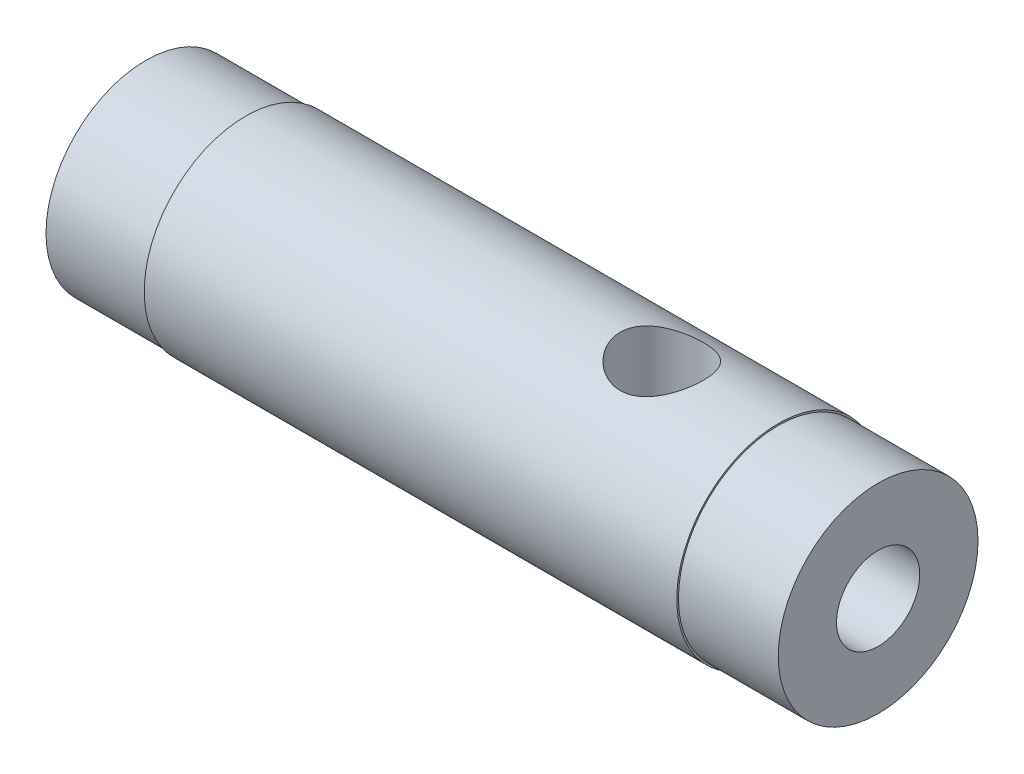
ISO-10303-21;
HEADER;
FILE_DESCRIPTION(('STEP AP214'),'2;1');
FILE_NAME('part.step','',(''),(''),'','','');
FILE_SCHEMA(('AUTOMOTIVE_DESIGN { 1 0 10303 214 1 1 1 1 }'));
ENDSEC;
DATA;
#1=APPLICATION_CONTEXT('core data for automotive mechanical design processes');
#2=APPLICATION_PROTOCOL_DEFINITION('international standard','automotive_design',2000,#1);
#3=PRODUCT_CONTEXT('',#1,'mechanical');
#4=PRODUCT('Part','Part','',(#3));
#5=PRODUCT_RELATED_PRODUCT_CATEGORY('part','',(#4));
#6=PRODUCT_DEFINITION_FORMATION('','',#4);
#7=PRODUCT_DEFINITION_CONTEXT('part definition',#1,'design');
#8=PRODUCT_DEFINITION('design','',#6,#7);
#9=PRODUCT_DEFINITION_SHAPE('','',#8);
#10=(LENGTH_UNIT() NAMED_UNIT(*) SI_UNIT(.MILLI.,.METRE.));
#11=(NAMED_UNIT(*) PLANE_ANGLE_UNIT() SI_UNIT($,.RADIAN.));
#12=(NAMED_UNIT(*) SI_UNIT($,.STERADIAN.) SOLID_ANGLE_UNIT());
#13=UNCERTAINTY_MEASURE_WITH_UNIT(LENGTH_MEASURE(1.E-05),#10,'distance_accuracy_value','');
#14=(GEOMETRIC_REPRESENTATION_CONTEXT(3) GLOBAL_UNCERTAINTY_ASSIGNED_CONTEXT((#13)) GLOBAL_UNIT_ASSIGNED_CONTEXT((#10,
#11,#12)) REPRESENTATION_CONTEXT('',''));
#15=CARTESIAN_POINT('',(0.,0.,0.));
#16=DIRECTION('',(0.,0.,1.));
#17=DIRECTION('',(1.,0.,0.));
#18=AXIS2_PLACEMENT_3D('',#15,#16,#17);
#19=CARTESIAN_POINT('',(-97.1117705949657,0.,0.));
#20=DIRECTION('',(1.,0.,0.));
#21=DIRECTION('',(0.,0.,-1.));
#22=AXIS2_PLACEMENT_3D('',#19,#20,#21);
#23=CYLINDRICAL_SURFACE('',#22,3.05000000000001);
#24=CARTESIAN_POINT('',(-8.00000000000001,0.,0.));
#25=DIRECTION('',(1.,0.,0.));
#26=DIRECTION('',(0.,0.,-1.));
#27=AXIS2_PLACEMENT_3D('',#24,#25,#26);
#28=CIRCLE('',#27,3.05000000000001);
#29=CARTESIAN_POINT('',(-8.00000000000001,0.,-3.05000000000001));
#30=VERTEX_POINT('',#29);
#31=EDGE_CURVE('E127',#30,#30,#28,.T.);
#32=ORIENTED_EDGE('',*,*,#31,.T.);
#33=EDGE_LOOP('',(#32));
#34=FACE_BOUND('',#33,.T.);
#35=CARTESIAN_POINT('',(8.00000000000001,0.,0.));
#36=DIRECTION('',(1.,0.,0.));
#37=DIRECTION('',(0.,0.,-1.));
#38=AXIS2_PLACEMENT_3D('',#35,#36,#37);
#39=CIRCLE('',#38,3.05000000000001);
#40=CARTESIAN_POINT('',(8.00000000000001,0.,-3.05000000000001));
#41=VERTEX_POINT('',#40);
#42=EDGE_CURVE('E130',#41,#41,#39,.T.);
#43=ORIENTED_EDGE('',*,*,#42,.F.);
#44=EDGE_LOOP('',(#43));
#45=FACE_BOUND('',#44,.T.);
#46=CARTESIAN_POINT('',(5.75,3.05000000000001,0.));
#47=CARTESIAN_POINT('',(5.74999317358084,3.04999490136042,0.0670510544943488));
#48=CARTESIAN_POINT('',(5.7445728904159,3.04776316601175,0.13421220939516));
#49=CARTESIAN_POINT('',(5.72308214272691,3.03905220749817,0.266635315129613));
#50=CARTESIAN_POINT('',(5.7069833965083,3.03256170556951,0.331891740879612));
#51=CARTESIAN_POINT('',(5.66482596800736,3.01603149034564,0.458374292847516));
#52=CARTESIAN_POINT('',(5.63880056530878,3.00600364451596,0.519613092935801));
#53=CARTESIAN_POINT('',(5.57766372514542,2.98337979201623,0.636797753940146));
#54=CARTESIAN_POINT('',(5.54255520538644,2.97078461030853,0.692745306660152));
#55=CARTESIAN_POINT('',(5.46243359833868,2.94360272183733,0.800582682290264));
#56=CARTESIAN_POINT('',(5.41704813784626,2.92895218720806,0.852179618836314));
#57=CARTESIAN_POINT('',(5.31844769395315,2.89959358202881,0.94727980579278));
#58=CARTESIAN_POINT('',(5.26522873562099,2.88488548598072,0.990778921618126));
#59=CARTESIAN_POINT('',(5.14942208796871,2.85630174305005,1.07047635819199));
#60=CARTESIAN_POINT('',(5.08651058665789,2.84249824263374,1.10623272255294));
#61=CARTESIAN_POINT('',(4.95491722684178,2.81829427065236,1.16652509902148));
#62=CARTESIAN_POINT('',(4.88623826542879,2.80789210323987,1.1910667050528));
#63=CARTESIAN_POINT('',(4.74842884283273,2.79235707938263,1.227033698322));
#64=CARTESIAN_POINT('',(4.67947149284317,2.78699943260885,1.23902161527503));
#65=CARTESIAN_POINT('',(4.54033187566907,2.78151145539134,1.25129693566521));
#66=CARTESIAN_POINT('',(4.47015027248522,2.78137837438495,1.25159049579919));
#67=CARTESIAN_POINT('',(4.33607409840986,2.78616368996564,1.24089353762405));
#68=CARTESIAN_POINT('',(4.27209740726591,2.7907104791605,1.23073314256809));
#69=CARTESIAN_POINT('',(4.14685271703793,2.80371701324259,1.20080567936669));
#70=CARTESIAN_POINT('',(4.08558521945647,2.81217747930139,1.18103684064336));
#71=CARTESIAN_POINT('',(3.96597856734735,2.8322471574019,1.13207159424285));
#72=CARTESIAN_POINT('',(3.90772757534972,2.84391858333762,1.10268647565431));
#73=CARTESIAN_POINT('',(3.79676189319712,2.86907953784481,1.03545581744839));
#74=CARTESIAN_POINT('',(3.74404935655717,2.88256976900068,0.997607004659702));
#75=CARTESIAN_POINT('',(3.64113506271574,2.91118669367847,0.910899790311777));
#76=CARTESIAN_POINT('',(3.59148817119212,2.92635714795842,0.861395461770469));
#77=CARTESIAN_POINT('',(3.50101833818233,2.95569448523892,0.754608431641011));
#78=CARTESIAN_POINT('',(3.46019733238115,2.96986114763169,0.697324028210361));
#79=CARTESIAN_POINT('',(3.38776019476993,2.99598214323012,0.574963428546575));
#80=CARTESIAN_POINT('',(3.35636271935723,3.00788187819975,0.509745275727025));
#81=CARTESIAN_POINT('',(3.30517803112996,3.0277118513072,0.37434088842293));
#82=CARTESIAN_POINT('',(3.28538461664023,3.03564420943662,0.304157330168565));
#83=CARTESIAN_POINT('',(3.25911499785756,3.04625363825053,0.165457200410405));
#84=CARTESIAN_POINT('',(3.25189372784432,3.04922426910948,0.0971041510370846));
#85=CARTESIAN_POINT('',(3.24876092149754,3.05050746127451,-0.0398955862818339));
#86=CARTESIAN_POINT('',(3.25284627086616,3.04882130524733,-0.108542188170875));
#87=CARTESIAN_POINT('',(3.27167121733154,3.04117156509263,-0.240737900013712));
#88=CARTESIAN_POINT('',(3.28589367478942,3.03541570476585,-0.304374017081181));
#89=CARTESIAN_POINT('',(3.32387605471634,3.02042451329167,-0.428291837516551));
#90=CARTESIAN_POINT('',(3.34763719121059,3.01118873925114,-0.488573112788121));
#91=CARTESIAN_POINT('',(3.40479928404273,2.98977295322552,-0.606169889878375));
#92=CARTESIAN_POINT('',(3.43847544195123,2.97751077732147,-0.663336176977042));
#93=CARTESIAN_POINT('',(3.51420811639302,2.95135965585716,-0.771409581257715));
#94=CARTESIAN_POINT('',(3.55626807827196,2.93747004246778,-0.822314111200647));
#95=CARTESIAN_POINT('',(3.65098440399942,2.90837761739881,-0.92012008901335));
#96=CARTESIAN_POINT('',(3.70417275944045,2.89315046142816,-0.966500457883186));
#97=CARTESIAN_POINT('',(3.81783195761041,2.86397295744694,-1.04981547564094));
#98=CARTESIAN_POINT('',(3.87830425548019,2.85002286554326,-1.08674823252482));
#99=CARTESIAN_POINT('',(4.00591935720062,2.82491824303053,-1.15044727242197));
#100=CARTESIAN_POINT('',(4.0731350035576,2.81380017451011,-1.17708303960167));
#101=CARTESIAN_POINT('',(4.21169404128461,2.79614362783963,-1.21843997613925));
#102=CARTESIAN_POINT('',(4.28303413036748,2.78960153937765,-1.2331705397777));
#103=CARTESIAN_POINT('',(4.42205571719577,2.78237686582238,-1.24938002982017));
#104=CARTESIAN_POINT('',(4.48961071540186,2.78129189039515,-1.25176935125866));
#105=CARTESIAN_POINT('',(4.62411541510115,2.78404131006806,-1.245642582678));
#106=CARTESIAN_POINT('',(4.6910652011546,2.78787500688881,-1.23712804062635));
#107=CARTESIAN_POINT('',(4.8194595845332,2.79966724973415,-1.21019142460486));
#108=CARTESIAN_POINT('',(4.88101694579431,2.80743875303862,-1.19221729367759));
#109=CARTESIAN_POINT('',(5.00026093044538,2.82609039777682,-1.14730173944125));
#110=CARTESIAN_POINT('',(5.0579464682445,2.83697140660188,-1.12035781367662));
#111=CARTESIAN_POINT('',(5.17152052867125,2.86141244323643,-1.05643453179975));
#112=CARTESIAN_POINT('',(5.22710231558399,2.87509264152989,-1.0189569500526));
#113=CARTESIAN_POINT('',(5.33147333634056,2.90324259102356,-0.935740453402653));
#114=CARTESIAN_POINT('',(5.3802603307468,2.91771260035407,-0.889998826180312));
#115=CARTESIAN_POINT('',(5.47314082024466,2.94701985281456,-0.787775119330134));
#116=CARTESIAN_POINT('',(5.51667265144534,2.96181275182101,-0.730767593453201));
#117=CARTESIAN_POINT('',(5.59357367951556,2.98908126299054,-0.609702629948095));
#118=CARTESIAN_POINT('',(5.62693821461591,3.00155581115558,-0.545641976686485));
#119=CARTESIAN_POINT('',(5.68180811191665,3.02258806460316,-0.413363701295479));
#120=CARTESIAN_POINT('',(5.70351052450806,3.03121040731176,-0.345238284795166));
#121=CARTESIAN_POINT('',(5.73495872650017,3.04383134859935,-0.206003832466595));
#122=CARTESIAN_POINT('',(5.74474216568277,3.04784450441535,-0.134904929290663));
#123=CARTESIAN_POINT('',(5.74946289651355,3.0497805301545,-0.0423987566110851));
#124=CARTESIAN_POINT('',(5.75000215885385,3.05000161244388,-0.0212048840938348));
#125=CARTESIAN_POINT('',(5.75,3.05000000000001,0.));
#126=B_SPLINE_CURVE_WITH_KNOTS('',3,(#46,#47,#48,#49,#50,#51,#52,#53,#54,#55,#56,#57,#58,#59,
#60,#61,#62,#63,#64,#65,#66,#67,#68,#69,#70,#71,#72,#73,#74,#75,#76,#77,#78,#79,#80,#81,#82,#83,
#84,#85,#86,#87,#88,#89,#90,#91,#92,#93,#94,#95,#96,#97,#98,#99,#100,#101,#102,#103,#104,#105,
#106,#107,#108,#109,#110,#111,#112,#113,#114,#115,#116,#117,#118,#119,#120,#121,#122,#123,#124,
#125),.UNSPECIFIED.,.T.,.F.,(4,2,2,2,2,2,2,2,2,2,2,2,2,2,2,2,2,2,2,2,2,2,2,2,2,2,2,2,2,2,2,2,2,
2,2,2,2,2,2,4),(0.,0.201094311180328,0.402723354574276,0.603682285542813,0.804576743863711,
1.0144449209133,1.22441996030868,1.4443140997696,1.66409843594336,1.87354721803842,
2.08288573073389,2.27679448285736,2.47073898070665,2.66874390795884,2.86682554265504,
3.08105274490334,3.29532688370778,3.51424468844057,3.73304538781656,3.93837132545349,
4.14364071369574,4.33912550528583,4.53463518488674,4.73618655641972,4.93782092740473,
5.15341391236426,5.36905003881045,5.58733616568889,5.80544987646516,6.00721727204665,
6.20895602688517,6.40190297186304,6.59490379169179,6.79928960640034,7.00374262427852,
7.22240178249371,7.44116104698127,7.65609749208752,7.87035321839586,7.93394925864707),.UNSPECIFIED.);
#127=CARTESIAN_POINT('',(5.75,3.05000000000001,0.));
#128=VERTEX_POINT('',#127);
#129=EDGE_CURVE('E96',#128,#128,#126,.T.);
#130=ORIENTED_EDGE('',*,*,#129,.T.);
#131=EDGE_LOOP('',(#130));
#132=FACE_BOUND('',#131,.T.);
#133=ADVANCED_FACE('F33',(#34,#45,#132),#23,.T.);
#134=CARTESIAN_POINT('',(0.999999999999999,0.,0.));
#135=DIRECTION('',(1.,0.,0.));
#136=DIRECTION('',(0.,0.,-1.));
#137=AXIS2_PLACEMENT_3D('',#134,#135,#136);
#138=CYLINDRICAL_SURFACE('',#137,1.);
#139=CARTESIAN_POINT('',(9.,0.,0.));
#140=DIRECTION('',(1.,0.,0.));
#141=DIRECTION('',(0.,0.,-1.));
#142=AXIS2_PLACEMENT_3D('',#139,#140,#141);
#143=CIRCLE('',#142,1.);
#144=CARTESIAN_POINT('',(9.,0.,-1.));
#145=VERTEX_POINT('',#144);
#146=EDGE_CURVE('E102',#145,#145,#143,.T.);
#147=ORIENTED_EDGE('',*,*,#146,.T.);
#148=EDGE_LOOP('',(#147));
#149=FACE_BOUND('',#148,.T.);
#150=CARTESIAN_POINT('',(0.999999999999999,0.,0.));
#151=DIRECTION('',(1.,0.,0.));
#152=DIRECTION('',(0.,0.,-1.));
#153=AXIS2_PLACEMENT_3D('',#150,#151,#152);
#154=CIRCLE('',#153,1.);
#155=CARTESIAN_POINT('',(0.999999999999999,0.,-1.));
#156=VERTEX_POINT('',#155);
#157=EDGE_CURVE('E141',#156,#156,#154,.T.);
#158=ORIENTED_EDGE('',*,*,#157,.F.);
#159=EDGE_LOOP('',(#158));
#160=FACE_BOUND('',#159,.T.);
#161=DIRECTION('',(1.,0.,0.));
#162=VECTOR('',#161,1.);
#163=CARTESIAN_POINT('',(0.999999999999999,0.,1.));
#164=LINE('',#163,#162);
#165=CARTESIAN_POINT('',(5.25,0.,1.));
#166=VERTEX_POINT('',#165);
#167=CARTESIAN_POINT('',(3.75,0.,1.));
#168=VERTEX_POINT('',#167);
#169=EDGE_CURVE('E11',#166,#168,#164,.F.);
#170=ORIENTED_EDGE('',*,*,#169,.F.);
#171=CARTESIAN_POINT('',(5.25,0.,-1.));
#172=CARTESIAN_POINT('',(5.24987067623704,0.0380129766276087,-1.00004239994648));
#173=CARTESIAN_POINT('',(5.25289103004996,0.0758275155938789,-0.997836474983586));
#174=CARTESIAN_POINT('',(5.26397459584319,0.149745040245508,-0.989402301671296));
#175=CARTESIAN_POINT('',(5.27196843860068,0.185864339148891,-0.983229346307377));
#176=CARTESIAN_POINT('',(5.29534501534317,0.268707378731975,-0.964471732244661));
#177=CARTESIAN_POINT('',(5.31234690354174,0.314612386155176,-0.950384680660607));
#178=CARTESIAN_POINT('',(5.35037942272485,0.402784905806841,-0.916522193316677));
#179=CARTESIAN_POINT('',(5.37143922783841,0.445022652171018,-0.896705010558024));
#180=CARTESIAN_POINT('',(5.42313921194292,0.540201153030468,-0.843872960776305));
#181=CARTESIAN_POINT('',(5.45450402336844,0.591538827620781,-0.808674279042955));
#182=CARTESIAN_POINT('',(5.5164732592259,0.687035191040317,-0.729262171177428));
#183=CARTESIAN_POINT('',(5.54707901332387,0.731207314549791,-0.685065973845451));
#184=CARTESIAN_POINT('',(5.59895111616673,0.803549549289894,-0.59738381575907));
#185=CARTESIAN_POINT('',(5.62086929566955,0.833157650129419,-0.555474703797675));
#186=CARTESIAN_POINT('',(5.66082242902013,0.886178594795774,-0.466231173247663));
#187=CARTESIAN_POINT('',(5.67886270124157,0.909599933711891,-0.418904323224978));
#188=CARTESIAN_POINT('',(5.70707838724441,0.945856702533569,-0.327657998123031));
#189=CARTESIAN_POINT('',(5.7180539649432,0.959791646820216,-0.284425664917518));
#190=CARTESIAN_POINT('',(5.73542973000579,0.981749555646113,-0.195592838876207));
#191=CARTESIAN_POINT('',(5.74183253802269,0.989775906479984,-0.149993718545756));
#192=CARTESIAN_POINT('',(5.74953985523491,0.999429061049003,-0.0575240307640927));
#193=CARTESIAN_POINT('',(5.75082663121042,1.00103360560954,-0.0106496069422968));
#194=CARTESIAN_POINT('',(5.74813465733429,0.997667853243521,0.0827084607393311));
#195=CARTESIAN_POINT('',(5.74415569505575,0.992697291068389,0.129192088757809));
#196=CARTESIAN_POINT('',(5.73164197425201,0.976966189364718,0.217840752947662));
#197=CARTESIAN_POINT('',(5.72336742128652,0.96653608943226,0.260103069944626));
#198=CARTESIAN_POINT('',(5.70302304698824,0.940653126263295,0.342084024447004));
#199=CARTESIAN_POINT('',(5.69095208673973,0.925198755707235,0.381801894313005));
#200=CARTESIAN_POINT('',(5.66242932183417,0.888197321851619,0.461768671333843));
#201=CARTESIAN_POINT('',(5.64566730645162,0.86620643025013,0.501699422986387));
#202=CARTESIAN_POINT('',(5.60946555279251,0.817724747800801,0.577363035500914));
#203=CARTESIAN_POINT('',(5.59002495442489,0.791232510934534,0.613094541131814));
#204=CARTESIAN_POINT('',(5.54528145200121,0.728488383702324,0.687109623020992));
#205=CARTESIAN_POINT('',(5.5195949170613,0.691349706949347,0.724408177137869));
#206=CARTESIAN_POINT('',(5.46749193838368,0.611920872614312,0.792656695821792));
#207=CARTESIAN_POINT('',(5.44107391347094,0.569618750861443,0.823591452247028));
#208=CARTESIAN_POINT('',(5.39215418239367,0.484296418009533,0.876199052099706));
#209=CARTESIAN_POINT('',(5.36951864411519,0.441724573038847,0.898471959775695));
#210=CARTESIAN_POINT('',(5.32782480986552,0.352614668010067,0.937018513226683));
#211=CARTESIAN_POINT('',(5.30874361455761,0.306105020498242,0.953331263548851));
#212=CARTESIAN_POINT('',(5.27987865780746,0.21714294138014,0.977028295888454));
#213=CARTESIAN_POINT('',(5.26907025585784,0.175326495703558,0.985453607049307));
#214=CARTESIAN_POINT('',(5.25784464586782,0.110847940155437,0.994079660457727));
#215=CARTESIAN_POINT('',(5.25493122509159,0.0888777407056976,0.99628744460861));
#216=CARTESIAN_POINT('',(5.25099697362387,0.0446130051879239,0.999252642595954));
#217=CARTESIAN_POINT('',(5.24998135737073,0.0223177446473524,1.0000060605793));
#218=CARTESIAN_POINT('',(5.25000000000004,0.,1.00000000000001));
#219=B_SPLINE_CURVE_WITH_KNOTS('',3,(#171,#172,#173,#174,#175,#176,#177,#178,#179,#180,#181,
#182,#183,#184,#185,#186,#187,#188,#189,#190,#191,#192,#193,#194,#195,#196,#197,#198,#199,#200,
#201,#202,#203,#204,#205,#206,#207,#208,#209,#210,#211,#212,#213,#214,#215,#216,#217,#218),
.UNSPECIFIED.,.F.,.F.,(4,2,2,2,2,2,2,2,2,2,2,2,2,2,2,2,2,2,2,2,2,2,2,4),(0.,0.113538161589319,
0.225527159749816,0.37750471337288,0.530618672369757,0.738714715684919,0.946415974333433,
1.11318075129622,1.27971533775768,1.41931198339593,1.55882856189424,1.69882831414268,
1.83883371433993,1.97120612225622,2.10361827960958,2.24879963014769,2.39402770742755,
2.56910640453789,2.74459876318906,2.90345202850739,3.06124350350388,3.19245916340866,
3.25915499815905,3.32603381952746),.UNSPECIFIED.);
#220=CARTESIAN_POINT('',(5.25,0.,-1.));
#221=VERTEX_POINT('',#220);
#222=EDGE_CURVE('E41',#221,#166,#219,.T.);
#223=ORIENTED_EDGE('',*,*,#222,.F.);
#224=DIRECTION('',(1.,0.,0.));
#225=VECTOR('',#224,1.);
#226=CARTESIAN_POINT('',(0.999999999999999,0.,-1.));
#227=LINE('',#226,#225);
#228=CARTESIAN_POINT('',(3.75,0.,-1.));
#229=VERTEX_POINT('',#228);
#230=EDGE_CURVE('E69',#229,#221,#227,.T.);
#231=ORIENTED_EDGE('',*,*,#230,.F.);
#232=CARTESIAN_POINT('',(3.75,0.,1.));
#233=CARTESIAN_POINT('',(3.75012932376296,0.0380129766276086,1.00004239994648));
#234=CARTESIAN_POINT('',(3.74710896995004,0.075827515593879,0.997836474983586));
#235=CARTESIAN_POINT('',(3.73602540415681,0.149745040245508,0.989402301671296));
#236=CARTESIAN_POINT('',(3.72803156139932,0.185864339148891,0.983229346307377));
#237=CARTESIAN_POINT('',(3.70465498465683,0.268707378731975,0.964471732244661));
#238=CARTESIAN_POINT('',(3.68765309645826,0.314612386155176,0.950384680660607));
#239=CARTESIAN_POINT('',(3.64962057727515,0.40278490580684,0.916522193316677));
#240=CARTESIAN_POINT('',(3.62856077216159,0.445022652171018,0.896705010558024));
#241=CARTESIAN_POINT('',(3.57686078805707,0.540201153030468,0.843872960776305));
#242=CARTESIAN_POINT('',(3.54549597663156,0.591538827620781,0.808674279042955));
#243=CARTESIAN_POINT('',(3.4835267407741,0.687035191040317,0.729262171177429));
#244=CARTESIAN_POINT('',(3.45292098667613,0.731207314549791,0.685065973845451));
#245=CARTESIAN_POINT('',(3.40104888383327,0.803549549289893,0.597383815759071));
#246=CARTESIAN_POINT('',(3.37913070433045,0.833157650129419,0.555474703797676));
#247=CARTESIAN_POINT('',(3.33917757097987,0.886178594795774,0.466231173247663));
#248=CARTESIAN_POINT('',(3.32113729875843,0.909599933711891,0.418904323224979));
#249=CARTESIAN_POINT('',(3.29292161275559,0.945856702533569,0.327657998123032));
#250=CARTESIAN_POINT('',(3.2819460350568,0.959791646820216,0.284425664917519));
#251=CARTESIAN_POINT('',(3.26457026999421,0.981749555646113,0.195592838876208));
#252=CARTESIAN_POINT('',(3.25816746197731,0.989775906479984,0.149993718545757));
#253=CARTESIAN_POINT('',(3.25046014476509,0.999429061049002,0.0575240307640932));
#254=CARTESIAN_POINT('',(3.24917336878958,1.00103360560954,0.0106496069422972));
#255=CARTESIAN_POINT('',(3.25186534266571,0.997667853243521,-0.0827084607393306));
#256=CARTESIAN_POINT('',(3.25584430494425,0.992697291068389,-0.129192088757808));
#257=CARTESIAN_POINT('',(3.26835802574799,0.976966189364718,-0.217840752947662));
#258=CARTESIAN_POINT('',(3.27663257871348,0.966536089432261,-0.260103069944626));
#259=CARTESIAN_POINT('',(3.29697695301176,0.940653126263295,-0.342084024447004));
#260=CARTESIAN_POINT('',(3.30904791326026,0.925198755707236,-0.381801894313005));
#261=CARTESIAN_POINT('',(3.33757067816583,0.888197321851619,-0.461768671333843));
#262=CARTESIAN_POINT('',(3.35433269354838,0.86620643025013,-0.501699422986386));
#263=CARTESIAN_POINT('',(3.39053444720748,0.817724747800801,-0.577363035500914));
#264=CARTESIAN_POINT('',(3.40997504557511,0.791232510934535,-0.613094541131813));
#265=CARTESIAN_POINT('',(3.45471854799879,0.728488383702324,-0.687109623020991));
#266=CARTESIAN_POINT('',(3.4804050829387,0.691349706949348,-0.724408177137869));
#267=CARTESIAN_POINT('',(3.53250806161632,0.611920872614313,-0.792656695821792));
#268=CARTESIAN_POINT('',(3.55892608652906,0.569618750861443,-0.823591452247027));
#269=CARTESIAN_POINT('',(3.60784581760633,0.484296418009533,-0.876199052099706));
#270=CARTESIAN_POINT('',(3.63048135588481,0.441724573038847,-0.898471959775694));
#271=CARTESIAN_POINT('',(3.67217519013448,0.352614668010067,-0.937018513226683));
#272=CARTESIAN_POINT('',(3.69125638544239,0.306105020498242,-0.953331263548851));
#273=CARTESIAN_POINT('',(3.72012134219254,0.21714294138014,-0.977028295888454));
#274=CARTESIAN_POINT('',(3.73092974414216,0.175326495703558,-0.985453607049307));
#275=CARTESIAN_POINT('',(3.74215535413218,0.110847940155437,-0.994079660457727));
#276=CARTESIAN_POINT('',(3.74506877490841,0.0888777407056981,-0.99628744460861));
#277=CARTESIAN_POINT('',(3.74900302637612,0.0446130051879243,-0.999252642595954));
#278=CARTESIAN_POINT('',(3.75001864262927,0.0223177446473526,-1.0000060605793));
#279=CARTESIAN_POINT('',(3.74999999999996,0.,-1.00000000000001));
#280=B_SPLINE_CURVE_WITH_KNOTS('',3,(#232,#233,#234,#235,#236,#237,#238,#239,#240,#241,#242,
#243,#244,#245,#246,#247,#248,#249,#250,#251,#252,#253,#254,#255,#256,#257,#258,#259,#260,#261,
#262,#263,#264,#265,#266,#267,#268,#269,#270,#271,#272,#273,#274,#275,#276,#277,#278,#279),
.UNSPECIFIED.,.F.,.F.,(4,2,2,2,2,2,2,2,2,2,2,2,2,2,2,2,2,2,2,2,2,2,2,4),(0.,0.113538161589319,
0.225527159749816,0.37750471337288,0.530618672369757,0.738714715684919,0.946415974333432,
1.11318075129622,1.27971533775768,1.41931198339593,1.55882856189424,1.69882831414268,
1.83883371433993,1.97120612225622,2.10361827960958,2.24879963014769,2.39402770742755,
2.56910640453789,2.74459876318906,2.90345202850739,3.06124350350388,3.19245916340866,
3.25915499815905,3.32603381952746),.UNSPECIFIED.);
#281=EDGE_CURVE('E65',#168,#229,#280,.T.);
#282=ORIENTED_EDGE('',*,*,#281,.F.);
#283=EDGE_LOOP('',(#170,#223,#231,#282));
#284=FACE_BOUND('',#283,.T.);
#285=ADVANCED_FACE('F68',(#149,#160,#284),#138,.F.);
#286=CARTESIAN_POINT('',(-11.,0.,0.));
#287=DIRECTION('',(-1.,0.,0.));
#288=DIRECTION('',(0.,0.,1.));
#289=AXIS2_PLACEMENT_3D('',#286,#287,#288);
#290=PLANE('',#289);
#291=CARTESIAN_POINT('',(-11.,0.,0.));
#292=DIRECTION('',(1.,0.,0.));
#293=DIRECTION('',(0.,0.,-1.));
#294=AXIS2_PLACEMENT_3D('',#291,#292,#293);
#295=CIRCLE('',#294,3.00000000000001);
#296=CARTESIAN_POINT('',(-11.,0.,-3.00000000000001));
#297=VERTEX_POINT('',#296);
#298=EDGE_CURVE('E71',#297,#297,#295,.T.);
#299=ORIENTED_EDGE('',*,*,#298,.F.);
#300=EDGE_LOOP('',(#299));
#301=FACE_BOUND('',#300,.T.);
#302=ADVANCED_FACE('F35',(#301),#290,.T.);
#303=CARTESIAN_POINT('',(-97.1117705949657,0.,0.));
#304=DIRECTION('',(1.,0.,0.));
#305=DIRECTION('',(0.,0.,-1.));
#306=AXIS2_PLACEMENT_3D('',#303,#304,#305);
#307=CYLINDRICAL_SURFACE('',#306,3.00000000000001);
#308=ORIENTED_EDGE('',*,*,#298,.T.);
#309=EDGE_LOOP('',(#308));
#310=FACE_BOUND('',#309,.T.);
#311=CARTESIAN_POINT('',(-8.00000000000001,0.,0.));
#312=DIRECTION('',(1.,0.,0.));
#313=DIRECTION('',(0.,0.,-1.));
#314=AXIS2_PLACEMENT_3D('',#311,#312,#313);
#315=CIRCLE('',#314,3.00000000000001);
#316=CARTESIAN_POINT('',(-8.00000000000001,0.,-3.00000000000001));
#317=VERTEX_POINT('',#316);
#318=EDGE_CURVE('E126',#317,#317,#315,.T.);
#319=ORIENTED_EDGE('',*,*,#318,.F.);
#320=EDGE_LOOP('',(#319));
#321=FACE_BOUND('',#320,.T.);
#322=ADVANCED_FACE('F113',(#310,#321),#307,.T.);
#323=CARTESIAN_POINT('',(-8.,3.00000000000001,0.));
#324=DIRECTION('',(-1.,0.,0.));
#325=DIRECTION('',(0.,0.,1.));
#326=AXIS2_PLACEMENT_3D('',#323,#324,#325);
#327=PLANE('',#326);
#328=ORIENTED_EDGE('',*,*,#318,.T.);
#329=EDGE_LOOP('',(#328));
#330=FACE_BOUND('',#329,.T.);
#331=ORIENTED_EDGE('',*,*,#31,.F.);
#332=EDGE_LOOP('',(#331));
#333=FACE_BOUND('',#332,.T.);
#334=ADVANCED_FACE('F111',(#330,#333),#327,.T.);
#335=CARTESIAN_POINT('',(8.,3.05000000000001,0.));
#336=DIRECTION('',(1.,0.,0.));
#337=DIRECTION('',(0.,0.,-1.));
#338=AXIS2_PLACEMENT_3D('',#335,#336,#337);
#339=PLANE('',#338);
#340=ORIENTED_EDGE('',*,*,#42,.T.);
#341=EDGE_LOOP('',(#340));
#342=FACE_BOUND('',#341,.T.);
#343=CARTESIAN_POINT('',(8.00000000000001,0.,0.));
#344=DIRECTION('',(1.,0.,0.));
#345=DIRECTION('',(0.,0.,-1.));
#346=AXIS2_PLACEMENT_3D('',#343,#344,#345);
#347=CIRCLE('',#346,3.00000000000001);
#348=CARTESIAN_POINT('',(8.00000000000001,0.,-3.00000000000001));
#349=VERTEX_POINT('',#348);
#350=EDGE_CURVE('E135',#349,#349,#347,.T.);
#351=ORIENTED_EDGE('',*,*,#350,.F.);
#352=EDGE_LOOP('',(#351));
#353=FACE_BOUND('',#352,.T.);
#354=ADVANCED_FACE('F109',(#342,#353),#339,.T.);
#355=CARTESIAN_POINT('',(-97.1117705949657,0.,0.));
#356=DIRECTION('',(1.,0.,0.));
#357=DIRECTION('',(0.,0.,-1.));
#358=AXIS2_PLACEMENT_3D('',#355,#356,#357);
#359=CYLINDRICAL_SURFACE('',#358,3.00000000000001);
#360=ORIENTED_EDGE('',*,*,#350,.T.);
#361=EDGE_LOOP('',(#360));
#362=FACE_BOUND('',#361,.T.);
#363=CARTESIAN_POINT('',(11.,0.,0.));
#364=DIRECTION('',(1.,0.,0.));
#365=DIRECTION('',(0.,0.,-1.));
#366=AXIS2_PLACEMENT_3D('',#363,#364,#365);
#367=CIRCLE('',#366,3.00000000000001);
#368=CARTESIAN_POINT('',(11.,0.,-3.00000000000001));
#369=VERTEX_POINT('',#368);
#370=EDGE_CURVE('E138',#369,#369,#367,.T.);
#371=ORIENTED_EDGE('',*,*,#370,.F.);
#372=EDGE_LOOP('',(#371));
#373=FACE_BOUND('',#372,.T.);
#374=ADVANCED_FACE('F159',(#362,#373),#359,.T.);
#375=CARTESIAN_POINT('',(11.,3.00000000000001,0.));
#376=DIRECTION('',(1.,0.,0.));
#377=DIRECTION('',(0.,0.,-1.));
#378=AXIS2_PLACEMENT_3D('',#375,#376,#377);
#379=PLANE('',#378);
#380=CARTESIAN_POINT('',(11.,0.,0.));
#381=DIRECTION('',(1.,0.,0.));
#382=DIRECTION('',(0.,0.,-1.));
#383=AXIS2_PLACEMENT_3D('',#380,#381,#382);
#384=CIRCLE('',#383,1.25);
#385=CARTESIAN_POINT('',(11.,0.,-1.25));
#386=VERTEX_POINT('',#385);
#387=EDGE_CURVE('E145',#386,#386,#384,.T.);
#388=ORIENTED_EDGE('',*,*,#387,.F.);
#389=EDGE_LOOP('',(#388));
#390=FACE_BOUND('',#389,.T.);
#391=ORIENTED_EDGE('',*,*,#370,.T.);
#392=EDGE_LOOP('',(#391));
#393=FACE_BOUND('',#392,.T.);
#394=ADVANCED_FACE('F154',(#390,#393),#379,.T.);
#395=CARTESIAN_POINT('',(9.,0.,0.));
#396=DIRECTION('',(1.,0.,0.));
#397=DIRECTION('',(0.,0.,-1.));
#398=AXIS2_PLACEMENT_3D('',#395,#396,#397);
#399=CYLINDRICAL_SURFACE('',#398,1.25);
#400=CARTESIAN_POINT('',(9.,0.,0.));
#401=DIRECTION('',(1.,0.,0.));
#402=DIRECTION('',(0.,0.,-1.));
#403=AXIS2_PLACEMENT_3D('',#400,#401,#402);
#404=CIRCLE('',#403,1.25);
#405=CARTESIAN_POINT('',(9.,0.,-1.25));
#406=VERTEX_POINT('',#405);
#407=EDGE_CURVE('E144',#406,#406,#404,.T.);
#408=ORIENTED_EDGE('',*,*,#407,.F.);
#409=EDGE_LOOP('',(#408));
#410=FACE_BOUND('',#409,.T.);
#411=ORIENTED_EDGE('',*,*,#387,.T.);
#412=EDGE_LOOP('',(#411));
#413=FACE_BOUND('',#412,.T.);
#414=ADVANCED_FACE('F151',(#410,#413),#399,.F.);
#415=CARTESIAN_POINT('',(9.,0.,0.));
#416=DIRECTION('',(1.,0.,0.));
#417=DIRECTION('',(0.,0.,-1.));
#418=AXIS2_PLACEMENT_3D('',#415,#416,#417);
#419=PLANE('',#418);
#420=ORIENTED_EDGE('',*,*,#146,.F.);
#421=EDGE_LOOP('',(#420));
#422=FACE_BOUND('',#421,.T.);
#423=ORIENTED_EDGE('',*,*,#407,.T.);
#424=EDGE_LOOP('',(#423));
#425=FACE_BOUND('',#424,.T.);
#426=ADVANCED_FACE('F91',(#422,#425),#419,.T.);
#427=CARTESIAN_POINT('',(0.999999999999999,0.,0.));
#428=DIRECTION('',(1.,0.,0.));
#429=DIRECTION('',(0.,0.,-1.));
#430=AXIS2_PLACEMENT_3D('',#427,#428,#429);
#431=PLANE('',#430);
#432=ORIENTED_EDGE('',*,*,#157,.T.);
#433=EDGE_LOOP('',(#432));
#434=FACE_BOUND('',#433,.T.);
#435=ADVANCED_FACE('F89',(#434),#431,.T.);
#436=CARTESIAN_POINT('',(4.5,3.05000000000001,0.));
#437=DIRECTION('',(0.,-1.,0.));
#438=DIRECTION('',(0.,0.,-1.));
#439=AXIS2_PLACEMENT_3D('',#436,#437,#438);
#440=CYLINDRICAL_SURFACE('',#439,1.25);
#441=ORIENTED_EDGE('',*,*,#129,.F.);
#442=EDGE_LOOP('',(#441));
#443=FACE_BOUND('',#442,.T.);
#444=ORIENTED_EDGE('',*,*,#222,.T.);
#445=CARTESIAN_POINT('',(4.5,0.,0.));
#446=DIRECTION('',(0.,1.,0.));
#447=DIRECTION('',(0.,0.,1.));
#448=AXIS2_PLACEMENT_3D('',#445,#446,#447);
#449=CIRCLE('',#448,1.25);
#450=EDGE_CURVE('E61',#168,#166,#449,.T.);
#451=ORIENTED_EDGE('',*,*,#450,.F.);
#452=ORIENTED_EDGE('',*,*,#281,.T.);
#453=EDGE_CURVE('E47',#221,#229,#449,.T.);
#454=ORIENTED_EDGE('',*,*,#453,.F.);
#455=EDGE_LOOP('',(#444,#451,#452,#454));
#456=FACE_BOUND('',#455,.T.);
#457=ADVANCED_FACE('F60',(#443,#456),#440,.F.);
#458=CARTESIAN_POINT('',(4.5,0.,0.));
#459=DIRECTION('',(0.,1.,0.));
#460=DIRECTION('',(0.,0.,1.));
#461=AXIS2_PLACEMENT_3D('',#458,#459,#460);
#462=PLANE('',#461);
#463=ORIENTED_EDGE('',*,*,#169,.T.);
#464=ORIENTED_EDGE('',*,*,#450,.T.);
#465=EDGE_LOOP('',(#463,#464));
#466=FACE_BOUND('',#465,.T.);
#467=ADVANCED_FACE('F66',(#466),#462,.T.);
#468=ORIENTED_EDGE('',*,*,#230,.T.);
#469=ORIENTED_EDGE('',*,*,#453,.T.);
#470=EDGE_LOOP('',(#468,#469));
#471=FACE_BOUND('',#470,.T.);
#472=ADVANCED_FACE('F248',(#471),#462,.T.);
#473=CLOSED_SHELL('',(#133,#285,#302,#322,#334,#354,#374,#394,#414,#426,#435,#457,#467,#472));
#474=MANIFOLD_SOLID_BREP('B2',#473);
#475=ADVANCED_BREP_SHAPE_REPRESENTATION('',(#18,#474),#14);
#476=SHAPE_DEFINITION_REPRESENTATION(#9,#475);
ENDSEC;
END-ISO-10303-21;
